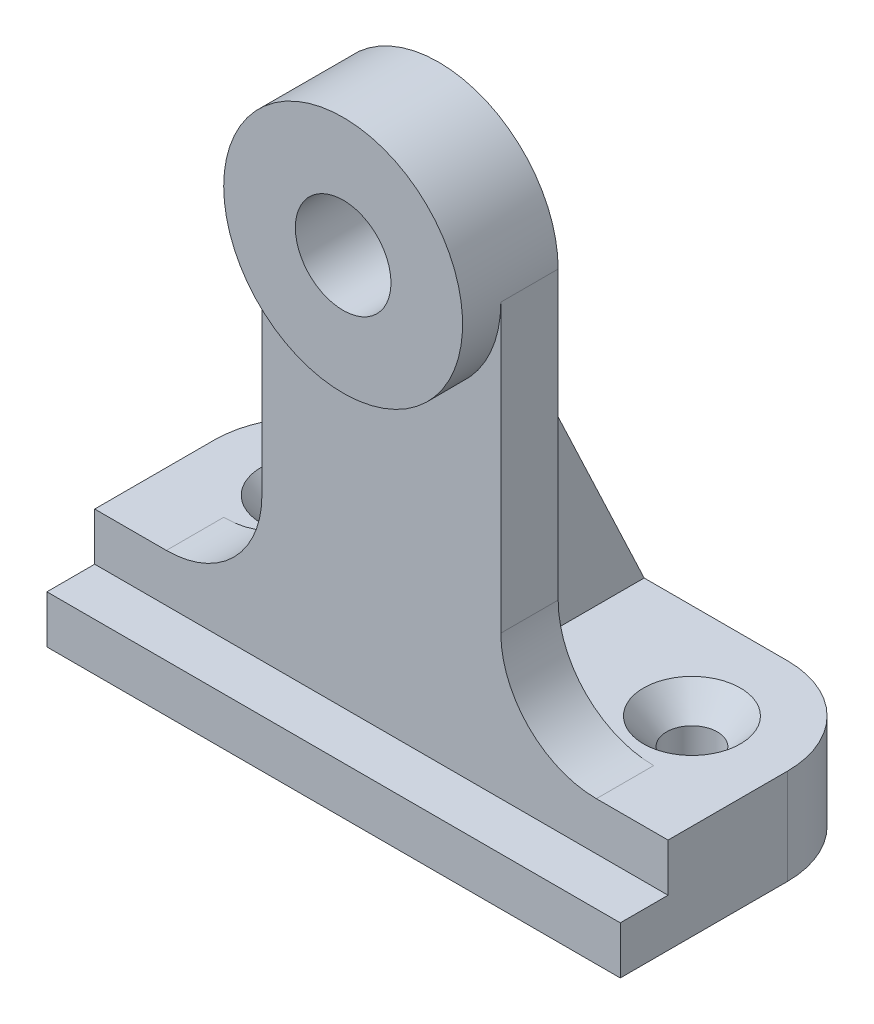
ISO-10303-21;
HEADER;
FILE_DESCRIPTION(('STEP AP214'),'2;1');
FILE_NAME('part.step','',(''),(''),'','','');
FILE_SCHEMA(('AUTOMOTIVE_DESIGN { 1 0 10303 214 1 1 1 1 }'));
ENDSEC;
DATA;
#1=APPLICATION_CONTEXT('core data for automotive mechanical design processes');
#2=APPLICATION_PROTOCOL_DEFINITION('international standard','automotive_design',2000,#1);
#3=PRODUCT_CONTEXT('',#1,'mechanical');
#4=PRODUCT('Part','Part','',(#3));
#5=PRODUCT_RELATED_PRODUCT_CATEGORY('part','',(#4));
#6=PRODUCT_DEFINITION_FORMATION('','',#4);
#7=PRODUCT_DEFINITION_CONTEXT('part definition',#1,'design');
#8=PRODUCT_DEFINITION('design','',#6,#7);
#9=PRODUCT_DEFINITION_SHAPE('','',#8);
#10=(LENGTH_UNIT() NAMED_UNIT(*) SI_UNIT(.MILLI.,.METRE.));
#11=(NAMED_UNIT(*) PLANE_ANGLE_UNIT() SI_UNIT($,.RADIAN.));
#12=(NAMED_UNIT(*) SI_UNIT($,.STERADIAN.) SOLID_ANGLE_UNIT());
#13=UNCERTAINTY_MEASURE_WITH_UNIT(LENGTH_MEASURE(1.E-05),#10,'distance_accuracy_value','');
#14=(GEOMETRIC_REPRESENTATION_CONTEXT(3) GLOBAL_UNCERTAINTY_ASSIGNED_CONTEXT((#13)) GLOBAL_UNIT_ASSIGNED_CONTEXT((#10,
#11,#12)) REPRESENTATION_CONTEXT('',''));
#15=CARTESIAN_POINT('',(0.,0.,0.));
#16=DIRECTION('',(0.,0.,1.));
#17=DIRECTION('',(1.,0.,0.));
#18=AXIS2_PLACEMENT_3D('',#15,#16,#17);
#19=CARTESIAN_POINT('',(25.4,12.7,-4.7625));
#20=DIRECTION('',(0.,-1.,0.));
#21=DIRECTION('',(0.,0.,-1.));
#22=AXIS2_PLACEMENT_3D('',#19,#20,#21);
#23=PLANE('',#22);
#24=CARTESIAN_POINT('',(-25.4,12.7,-4.7625));
#25=DIRECTION('',(0.,1.,0.));
#26=DIRECTION('',(0.,0.,1.));
#27=AXIS2_PLACEMENT_3D('',#24,#25,#26);
#28=CIRCLE('',#27,6.4389);
#29=CARTESIAN_POINT('',(-25.4,12.7,1.6764));
#30=VERTEX_POINT('',#29);
#31=EDGE_CURVE('E236',#30,#30,#28,.T.);
#32=ORIENTED_EDGE('',*,*,#31,.F.);
#33=EDGE_LOOP('',(#32));
#34=FACE_BOUND('',#33,.T.);
#35=DIRECTION('',(0.,0.,-1.));
#36=VECTOR('',#35,1.);
#37=CARTESIAN_POINT('',(-6.35,12.7,3.4925));
#38=LINE('',#37,#36);
#39=CARTESIAN_POINT('',(-6.35,12.7,3.4925));
#40=VERTEX_POINT('',#39);
#41=CARTESIAN_POINT('',(-6.35,12.7,-17.4625));
#42=VERTEX_POINT('',#41);
#43=EDGE_CURVE('E55',#40,#42,#38,.T.);
#44=ORIENTED_EDGE('',*,*,#43,.T.);
#45=DIRECTION('',(-1.,0.,0.));
#46=VECTOR('',#45,1.);
#47=CARTESIAN_POINT('',(-25.4,12.7,-17.4625));
#48=LINE('',#47,#46);
#49=CARTESIAN_POINT('',(-25.4,12.7,-17.4625));
#50=VERTEX_POINT('',#49);
#51=EDGE_CURVE('E295',#42,#50,#48,.T.);
#52=ORIENTED_EDGE('',*,*,#51,.T.);
#53=CARTESIAN_POINT('',(-25.4,12.7,-4.7625));
#54=DIRECTION('',(0.,1.,0.));
#55=DIRECTION('',(0.,0.,1.));
#56=AXIS2_PLACEMENT_3D('',#53,#54,#55);
#57=CIRCLE('',#56,12.7);
#58=CARTESIAN_POINT('',(-38.1,12.7,-4.7625));
#59=VERTEX_POINT('',#58);
#60=EDGE_CURVE('E300',#50,#59,#57,.T.);
#61=ORIENTED_EDGE('',*,*,#60,.T.);
#62=DIRECTION('',(0.,0.,1.));
#63=VECTOR('',#62,1.);
#64=CARTESIAN_POINT('',(-38.1,12.7,-4.76249999999999));
#65=LINE('',#64,#63);
#66=CARTESIAN_POINT('',(-38.1,12.7,11.1125));
#67=VERTEX_POINT('',#66);
#68=EDGE_CURVE('E303',#59,#67,#65,.T.);
#69=ORIENTED_EDGE('',*,*,#68,.T.);
#70=DIRECTION('',(1.,0.,0.));
#71=VECTOR('',#70,1.);
#72=CARTESIAN_POINT('',(-38.1,12.7,11.1125));
#73=LINE('',#72,#71);
#74=CARTESIAN_POINT('',(-28.575,12.7,11.1125));
#75=VERTEX_POINT('',#74);
#76=EDGE_CURVE('E307',#67,#75,#73,.T.);
#77=ORIENTED_EDGE('',*,*,#76,.T.);
#78=DIRECTION('',(0.,0.,1.));
#79=VECTOR('',#78,1.);
#80=CARTESIAN_POINT('',(-28.575,12.7,-4.7625));
#81=LINE('',#80,#79);
#82=CARTESIAN_POINT('',(-28.575,12.7,3.4925));
#83=VERTEX_POINT('',#82);
#84=EDGE_CURVE('E351',#75,#83,#81,.F.);
#85=ORIENTED_EDGE('',*,*,#84,.T.);
#86=DIRECTION('',(1.,0.,0.));
#87=VECTOR('',#86,1.);
#88=CARTESIAN_POINT('',(-15.875,12.7,3.4925));
#89=LINE('',#88,#87);
#90=EDGE_CURVE('E216',#83,#40,#89,.T.);
#91=ORIENTED_EDGE('',*,*,#90,.T.);
#92=EDGE_LOOP('',(#44,#52,#61,#69,#77,#85,#91));
#93=FACE_BOUND('',#92,.T.);
#94=ADVANCED_FACE('F39',(#34,#93),#23,.F.);
#95=CARTESIAN_POINT('',(25.4,12.7,-4.7625));
#96=DIRECTION('',(0.,1.,0.));
#97=DIRECTION('',(0.,0.,1.));
#98=AXIS2_PLACEMENT_3D('',#95,#96,#97);
#99=CIRCLE('',#98,6.4389);
#100=CARTESIAN_POINT('',(25.4,12.7,1.6764));
#101=VERTEX_POINT('',#100);
#102=EDGE_CURVE('E251',#101,#101,#99,.T.);
#103=ORIENTED_EDGE('',*,*,#102,.F.);
#104=EDGE_LOOP('',(#103));
#105=FACE_BOUND('',#104,.T.);
#106=CARTESIAN_POINT('',(25.4,12.7,-17.4625));
#107=VERTEX_POINT('',#106);
#108=CARTESIAN_POINT('',(6.35,12.7,-17.4625));
#109=VERTEX_POINT('',#108);
#110=EDGE_CURVE('E297',#107,#109,#48,.T.);
#111=ORIENTED_EDGE('',*,*,#110,.T.);
#112=DIRECTION('',(0.,0.,-1.));
#113=VECTOR('',#112,1.);
#114=CARTESIAN_POINT('',(6.35,12.7,3.4925));
#115=LINE('',#114,#113);
#116=CARTESIAN_POINT('',(6.35,12.7,3.4925));
#117=VERTEX_POINT('',#116);
#118=EDGE_CURVE('E409',#117,#109,#115,.T.);
#119=ORIENTED_EDGE('',*,*,#118,.F.);
#120=CARTESIAN_POINT('',(28.575,12.7,3.4925));
#121=VERTEX_POINT('',#120);
#122=EDGE_CURVE('E214',#117,#121,#89,.T.);
#123=ORIENTED_EDGE('',*,*,#122,.T.);
#124=DIRECTION('',(0.,0.,1.));
#125=VECTOR('',#124,1.);
#126=CARTESIAN_POINT('',(28.575,12.7,-4.7625));
#127=LINE('',#126,#125);
#128=CARTESIAN_POINT('',(28.575,12.7,11.1125));
#129=VERTEX_POINT('',#128);
#130=EDGE_CURVE('E355',#121,#129,#127,.T.);
#131=ORIENTED_EDGE('',*,*,#130,.T.);
#132=CARTESIAN_POINT('',(38.1,12.7,11.1125));
#133=VERTEX_POINT('',#132);
#134=EDGE_CURVE('E306',#129,#133,#73,.T.);
#135=ORIENTED_EDGE('',*,*,#134,.T.);
#136=DIRECTION('',(0.,0.,-1.));
#137=VECTOR('',#136,1.);
#138=CARTESIAN_POINT('',(38.1,12.7,-4.7625));
#139=LINE('',#138,#137);
#140=CARTESIAN_POINT('',(38.1,12.7,-4.7625));
#141=VERTEX_POINT('',#140);
#142=EDGE_CURVE('E311',#133,#141,#139,.T.);
#143=ORIENTED_EDGE('',*,*,#142,.T.);
#144=CARTESIAN_POINT('',(25.4,12.7,-4.7625));
#145=DIRECTION('',(0.,1.,0.));
#146=DIRECTION('',(0.,0.,-1.));
#147=AXIS2_PLACEMENT_3D('',#144,#145,#146);
#148=CIRCLE('',#147,12.7);
#149=EDGE_CURVE('E291',#141,#107,#148,.T.);
#150=ORIENTED_EDGE('',*,*,#149,.T.);
#151=EDGE_LOOP('',(#111,#119,#123,#131,#135,#143,#150));
#152=FACE_BOUND('',#151,.T.);
#153=ADVANCED_FACE('F399',(#105,#152),#23,.F.);
#154=CARTESIAN_POINT('',(-38.1,12.7,11.1125));
#155=DIRECTION('',(0.,0.,-1.));
#156=DIRECTION('',(-1.,0.,0.));
#157=AXIS2_PLACEMENT_3D('',#154,#155,#156);
#158=PLANE('',#157);
#159=DIRECTION('',(-1.,0.,0.));
#160=VECTOR('',#159,1.);
#161=CARTESIAN_POINT('',(-38.1,6.35,11.1125));
#162=LINE('',#161,#160);
#163=CARTESIAN_POINT('',(38.1,6.35,11.1125));
#164=VERTEX_POINT('',#163);
#165=CARTESIAN_POINT('',(-38.1,6.35,11.1125));
#166=VERTEX_POINT('',#165);
#167=EDGE_CURVE('E275',#164,#166,#162,.T.);
#168=ORIENTED_EDGE('',*,*,#167,.F.);
#169=DIRECTION('',(0.,-1.,0.));
#170=VECTOR('',#169,1.);
#171=CARTESIAN_POINT('',(38.1,12.7,11.1125));
#172=LINE('',#171,#170);
#173=EDGE_CURVE('E332',#133,#164,#172,.T.);
#174=ORIENTED_EDGE('',*,*,#173,.F.);
#175=ORIENTED_EDGE('',*,*,#134,.F.);
#176=CARTESIAN_POINT('',(28.575,25.4,11.1125));
#177=DIRECTION('',(0.,0.,-1.));
#178=DIRECTION('',(-1.,0.,0.));
#179=AXIS2_PLACEMENT_3D('',#176,#177,#178);
#180=CIRCLE('',#179,12.7);
#181=CARTESIAN_POINT('',(15.875,25.4,11.1125));
#182=VERTEX_POINT('',#181);
#183=EDGE_CURVE('E366',#129,#182,#180,.T.);
#184=ORIENTED_EDGE('',*,*,#183,.T.);
#185=DIRECTION('',(0.,1.,0.));
#186=VECTOR('',#185,1.);
#187=CARTESIAN_POINT('',(15.875,12.7,11.1125));
#188=LINE('',#187,#186);
#189=CARTESIAN_POINT('',(15.875,63.5,11.1125));
#190=VERTEX_POINT('',#189);
#191=EDGE_CURVE('E226',#182,#190,#188,.T.);
#192=ORIENTED_EDGE('',*,*,#191,.T.);
#193=CARTESIAN_POINT('',(0.,63.5,11.1125));
#194=DIRECTION('',(0.,0.,-1.));
#195=DIRECTION('',(1.,0.,0.));
#196=AXIS2_PLACEMENT_3D('',#193,#194,#195);
#197=CIRCLE('',#196,15.875);
#198=CARTESIAN_POINT('',(-15.875,63.5,11.1125));
#199=VERTEX_POINT('',#198);
#200=EDGE_CURVE('E215',#190,#199,#197,.T.);
#201=ORIENTED_EDGE('',*,*,#200,.T.);
#202=DIRECTION('',(0.,-1.,0.));
#203=VECTOR('',#202,1.);
#204=CARTESIAN_POINT('',(-15.875,12.7,11.1125));
#205=LINE('',#204,#203);
#206=CARTESIAN_POINT('',(-15.875,25.4,11.1125));
#207=VERTEX_POINT('',#206);
#208=EDGE_CURVE('E206',#199,#207,#205,.T.);
#209=ORIENTED_EDGE('',*,*,#208,.T.);
#210=CARTESIAN_POINT('',(-28.575,25.4,11.1125));
#211=DIRECTION('',(0.,0.,-1.));
#212=DIRECTION('',(-1.,0.,0.));
#213=AXIS2_PLACEMENT_3D('',#210,#211,#212);
#214=CIRCLE('',#213,12.7);
#215=EDGE_CURVE('E48',#207,#75,#214,.T.);
#216=ORIENTED_EDGE('',*,*,#215,.T.);
#217=ORIENTED_EDGE('',*,*,#76,.F.);
#218=DIRECTION('',(0.,-1.,0.));
#219=VECTOR('',#218,1.);
#220=CARTESIAN_POINT('',(-38.1,12.7,11.1125));
#221=LINE('',#220,#219);
#222=EDGE_CURVE('E336',#67,#166,#221,.T.);
#223=ORIENTED_EDGE('',*,*,#222,.T.);
#224=EDGE_LOOP('',(#168,#174,#175,#184,#192,#201,#209,#216,#217,#223));
#225=FACE_BOUND('',#224,.T.);
#226=ADVANCED_FACE('F375',(#225),#158,.F.);
#227=CARTESIAN_POINT('',(25.4,12.7,-4.7625));
#228=DIRECTION('',(0.,-1.,0.));
#229=DIRECTION('',(0.,0.,-1.));
#230=AXIS2_PLACEMENT_3D('',#227,#228,#229);
#231=CYLINDRICAL_SURFACE('',#230,12.7);
#232=CARTESIAN_POINT('',(25.4,0.,-4.7625));
#233=DIRECTION('',(0.,1.,0.));
#234=DIRECTION('',(0.,0.,-1.));
#235=AXIS2_PLACEMENT_3D('',#232,#233,#234);
#236=CIRCLE('',#235,12.7);
#237=CARTESIAN_POINT('',(38.1,0.,-4.7625));
#238=VERTEX_POINT('',#237);
#239=CARTESIAN_POINT('',(25.4,0.,-17.4625));
#240=VERTEX_POINT('',#239);
#241=EDGE_CURVE('E290',#238,#240,#236,.T.);
#242=ORIENTED_EDGE('',*,*,#241,.T.);
#243=DIRECTION('',(0.,-1.,0.));
#244=VECTOR('',#243,1.);
#245=CARTESIAN_POINT('',(25.4,12.7,-17.4625));
#246=LINE('',#245,#244);
#247=EDGE_CURVE('E347',#107,#240,#246,.T.);
#248=ORIENTED_EDGE('',*,*,#247,.F.);
#249=ORIENTED_EDGE('',*,*,#149,.F.);
#250=DIRECTION('',(0.,-1.,0.));
#251=VECTOR('',#250,1.);
#252=CARTESIAN_POINT('',(38.1,12.7,-4.7625));
#253=LINE('',#252,#251);
#254=EDGE_CURVE('E314',#141,#238,#253,.T.);
#255=ORIENTED_EDGE('',*,*,#254,.T.);
#256=EDGE_LOOP('',(#242,#248,#249,#255));
#257=FACE_BOUND('',#256,.T.);
#258=ADVANCED_FACE('F453',(#257),#231,.T.);
#259=CARTESIAN_POINT('',(-25.4,12.7,-17.4625));
#260=DIRECTION('',(0.,0.,1.));
#261=DIRECTION('',(1.,0.,0.));
#262=AXIS2_PLACEMENT_3D('',#259,#260,#261);
#263=PLANE('',#262);
#264=DIRECTION('',(-1.,0.,0.));
#265=VECTOR('',#264,1.);
#266=CARTESIAN_POINT('',(-25.4,0.,-17.4625));
#267=LINE('',#266,#265);
#268=CARTESIAN_POINT('',(-25.4,0.,-17.4625));
#269=VERTEX_POINT('',#268);
#270=EDGE_CURVE('E318',#240,#269,#267,.T.);
#271=ORIENTED_EDGE('',*,*,#270,.T.);
#272=DIRECTION('',(0.,-1.,0.));
#273=VECTOR('',#272,1.);
#274=CARTESIAN_POINT('',(-25.4,12.7,-17.4625));
#275=LINE('',#274,#273);
#276=EDGE_CURVE('E343',#50,#269,#275,.T.);
#277=ORIENTED_EDGE('',*,*,#276,.F.);
#278=ORIENTED_EDGE('',*,*,#51,.F.);
#279=DIRECTION('',(-1.,0.,0.));
#280=VECTOR('',#279,1.);
#281=CARTESIAN_POINT('',(6.35,12.7,-17.4625));
#282=LINE('',#281,#280);
#283=EDGE_CURVE('E62',#109,#42,#282,.T.);
#284=ORIENTED_EDGE('',*,*,#283,.F.);
#285=ORIENTED_EDGE('',*,*,#110,.F.);
#286=ORIENTED_EDGE('',*,*,#247,.T.);
#287=EDGE_LOOP('',(#271,#277,#278,#284,#285,#286));
#288=FACE_BOUND('',#287,.T.);
#289=ADVANCED_FACE('F460',(#288),#263,.F.);
#290=CARTESIAN_POINT('',(-25.4,12.7,-4.7625));
#291=DIRECTION('',(0.,-1.,0.));
#292=DIRECTION('',(0.,0.,-1.));
#293=AXIS2_PLACEMENT_3D('',#290,#291,#292);
#294=CYLINDRICAL_SURFACE('',#293,12.7);
#295=CARTESIAN_POINT('',(-25.4,0.,-4.7625));
#296=DIRECTION('',(0.,1.,0.));
#297=DIRECTION('',(0.,0.,1.));
#298=AXIS2_PLACEMENT_3D('',#295,#296,#297);
#299=CIRCLE('',#298,12.7);
#300=CARTESIAN_POINT('',(-38.1,0.,-4.7625));
#301=VERTEX_POINT('',#300);
#302=EDGE_CURVE('E321',#269,#301,#299,.T.);
#303=ORIENTED_EDGE('',*,*,#302,.T.);
#304=DIRECTION('',(0.,-1.,0.));
#305=VECTOR('',#304,1.);
#306=CARTESIAN_POINT('',(-38.1,12.7,-4.7625));
#307=LINE('',#306,#305);
#308=EDGE_CURVE('E339',#59,#301,#307,.T.);
#309=ORIENTED_EDGE('',*,*,#308,.F.);
#310=ORIENTED_EDGE('',*,*,#60,.F.);
#311=ORIENTED_EDGE('',*,*,#276,.T.);
#312=EDGE_LOOP('',(#303,#309,#310,#311));
#313=FACE_BOUND('',#312,.T.);
#314=ADVANCED_FACE('F456',(#313),#294,.T.);
#315=CARTESIAN_POINT('',(-38.1,12.7,-4.76249999999999));
#316=DIRECTION('',(1.,0.,0.));
#317=DIRECTION('',(0.,0.,-1.));
#318=AXIS2_PLACEMENT_3D('',#315,#316,#317);
#319=PLANE('',#318);
#320=DIRECTION('',(0.,0.,1.));
#321=VECTOR('',#320,1.);
#322=CARTESIAN_POINT('',(-38.1,0.,-4.76249999999999));
#323=LINE('',#322,#321);
#324=CARTESIAN_POINT('',(-38.1,0.,17.4625));
#325=VERTEX_POINT('',#324);
#326=EDGE_CURVE('E324',#301,#325,#323,.T.);
#327=ORIENTED_EDGE('',*,*,#326,.T.);
#328=DIRECTION('',(0.,-1.,0.));
#329=VECTOR('',#328,1.);
#330=CARTESIAN_POINT('',(-38.1,6.35,17.4625));
#331=LINE('',#330,#329);
#332=CARTESIAN_POINT('',(-38.1,6.35,17.4625));
#333=VERTEX_POINT('',#332);
#334=EDGE_CURVE('E286',#333,#325,#331,.T.);
#335=ORIENTED_EDGE('',*,*,#334,.F.);
#336=DIRECTION('',(0.,0.,1.));
#337=VECTOR('',#336,1.);
#338=CARTESIAN_POINT('',(-38.1,6.35,11.1125));
#339=LINE('',#338,#337);
#340=EDGE_CURVE('E264',#166,#333,#339,.T.);
#341=ORIENTED_EDGE('',*,*,#340,.F.);
#342=ORIENTED_EDGE('',*,*,#222,.F.);
#343=ORIENTED_EDGE('',*,*,#68,.F.);
#344=ORIENTED_EDGE('',*,*,#308,.T.);
#345=EDGE_LOOP('',(#327,#335,#341,#342,#343,#344));
#346=FACE_BOUND('',#345,.T.);
#347=ADVANCED_FACE('F449',(#346),#319,.F.);
#348=CARTESIAN_POINT('',(38.1,12.7,-4.7625));
#349=DIRECTION('',(-1.,0.,0.));
#350=DIRECTION('',(0.,0.,1.));
#351=AXIS2_PLACEMENT_3D('',#348,#349,#350);
#352=PLANE('',#351);
#353=DIRECTION('',(0.,0.,-1.));
#354=VECTOR('',#353,1.);
#355=CARTESIAN_POINT('',(38.1,0.,-4.7625));
#356=LINE('',#355,#354);
#357=CARTESIAN_POINT('',(38.1,0.,17.4625));
#358=VERTEX_POINT('',#357);
#359=EDGE_CURVE('E296',#358,#238,#356,.T.);
#360=ORIENTED_EDGE('',*,*,#359,.T.);
#361=ORIENTED_EDGE('',*,*,#254,.F.);
#362=ORIENTED_EDGE('',*,*,#142,.F.);
#363=ORIENTED_EDGE('',*,*,#173,.T.);
#364=DIRECTION('',(0.,0.,-1.));
#365=VECTOR('',#364,1.);
#366=CARTESIAN_POINT('',(38.1,6.35,11.1125));
#367=LINE('',#366,#365);
#368=CARTESIAN_POINT('',(38.1,6.35,17.4625));
#369=VERTEX_POINT('',#368);
#370=EDGE_CURVE('E271',#369,#164,#367,.T.);
#371=ORIENTED_EDGE('',*,*,#370,.F.);
#372=DIRECTION('',(0.,-1.,0.));
#373=VECTOR('',#372,1.);
#374=CARTESIAN_POINT('',(38.1,6.35,17.4625));
#375=LINE('',#374,#373);
#376=EDGE_CURVE('E279',#369,#358,#375,.T.);
#377=ORIENTED_EDGE('',*,*,#376,.T.);
#378=EDGE_LOOP('',(#360,#361,#362,#363,#371,#377));
#379=FACE_BOUND('',#378,.T.);
#380=ADVANCED_FACE('F445',(#379),#352,.F.);
#381=CARTESIAN_POINT('',(25.4,0.,-4.7625));
#382=DIRECTION('',(0.,-1.,0.));
#383=DIRECTION('',(0.,0.,-1.));
#384=AXIS2_PLACEMENT_3D('',#381,#382,#383);
#385=PLANE('',#384);
#386=CARTESIAN_POINT('',(-25.4,0.,-4.7625));
#387=DIRECTION('',(0.,1.,0.));
#388=DIRECTION('',(0.,0.,1.));
#389=AXIS2_PLACEMENT_3D('',#386,#387,#388);
#390=CIRCLE('',#389,3.3782);
#391=CARTESIAN_POINT('',(-25.4,0.,-1.3843));
#392=VERTEX_POINT('',#391);
#393=EDGE_CURVE('E247',#392,#392,#390,.T.);
#394=ORIENTED_EDGE('',*,*,#393,.T.);
#395=EDGE_LOOP('',(#394));
#396=FACE_BOUND('',#395,.T.);
#397=CARTESIAN_POINT('',(25.4,0.,-4.7625));
#398=DIRECTION('',(0.,1.,0.));
#399=DIRECTION('',(0.,0.,1.));
#400=AXIS2_PLACEMENT_3D('',#397,#398,#399);
#401=CIRCLE('',#400,3.3782);
#402=CARTESIAN_POINT('',(25.4,0.,-1.3843));
#403=VERTEX_POINT('',#402);
#404=EDGE_CURVE('E259',#403,#403,#401,.T.);
#405=ORIENTED_EDGE('',*,*,#404,.T.);
#406=EDGE_LOOP('',(#405));
#407=FACE_BOUND('',#406,.T.);
#408=ORIENTED_EDGE('',*,*,#241,.F.);
#409=ORIENTED_EDGE('',*,*,#359,.F.);
#410=DIRECTION('',(1.,0.,0.));
#411=VECTOR('',#410,1.);
#412=CARTESIAN_POINT('',(-38.1,0.,17.4625));
#413=LINE('',#412,#411);
#414=EDGE_CURVE('E263',#325,#358,#413,.T.);
#415=ORIENTED_EDGE('',*,*,#414,.F.);
#416=ORIENTED_EDGE('',*,*,#326,.F.);
#417=ORIENTED_EDGE('',*,*,#302,.F.);
#418=ORIENTED_EDGE('',*,*,#270,.F.);
#419=EDGE_LOOP('',(#408,#409,#415,#416,#417,#418));
#420=FACE_BOUND('',#419,.T.);
#421=ADVANCED_FACE('F442',(#396,#407,#420),#385,.T.);
#422=CARTESIAN_POINT('',(-38.1,6.35,17.4625));
#423=DIRECTION('',(0.,0.,-1.));
#424=DIRECTION('',(-1.,0.,0.));
#425=AXIS2_PLACEMENT_3D('',#422,#423,#424);
#426=PLANE('',#425);
#427=ORIENTED_EDGE('',*,*,#414,.T.);
#428=ORIENTED_EDGE('',*,*,#376,.F.);
#429=DIRECTION('',(1.,0.,0.));
#430=VECTOR('',#429,1.);
#431=CARTESIAN_POINT('',(-38.1,6.35,17.4625));
#432=LINE('',#431,#430);
#433=EDGE_CURVE('E268',#333,#369,#432,.T.);
#434=ORIENTED_EDGE('',*,*,#433,.F.);
#435=ORIENTED_EDGE('',*,*,#334,.T.);
#436=EDGE_LOOP('',(#427,#428,#434,#435));
#437=FACE_BOUND('',#436,.T.);
#438=ADVANCED_FACE('F440',(#437),#426,.F.);
#439=CARTESIAN_POINT('',(0.,6.35,0.));
#440=DIRECTION('',(0.,1.,0.));
#441=DIRECTION('',(0.,0.,1.));
#442=AXIS2_PLACEMENT_3D('',#439,#440,#441);
#443=PLANE('',#442);
#444=ORIENTED_EDGE('',*,*,#340,.T.);
#445=ORIENTED_EDGE('',*,*,#433,.T.);
#446=ORIENTED_EDGE('',*,*,#370,.T.);
#447=ORIENTED_EDGE('',*,*,#167,.T.);
#448=EDGE_LOOP('',(#444,#445,#446,#447));
#449=FACE_BOUND('',#448,.T.);
#450=ADVANCED_FACE('F495',(#449),#443,.T.);
#451=CARTESIAN_POINT('',(25.4,12.7,-4.7625));
#452=DIRECTION('',(0.,1.,0.));
#453=DIRECTION('',(0.,0.,1.));
#454=AXIS2_PLACEMENT_3D('',#451,#452,#453);
#455=CYLINDRICAL_SURFACE('',#454,3.3782);
#456=ORIENTED_EDGE('',*,*,#404,.F.);
#457=EDGE_LOOP('',(#456));
#458=FACE_BOUND('',#457,.T.);
#459=CARTESIAN_POINT('',(25.4,9.17906741601865,-4.7625));
#460=DIRECTION('',(0.,1.,0.));
#461=DIRECTION('',(0.,0.,1.));
#462=AXIS2_PLACEMENT_3D('',#459,#460,#461);
#463=CIRCLE('',#462,3.3782);
#464=CARTESIAN_POINT('',(25.4,9.17906741601865,-1.3843));
#465=VERTEX_POINT('',#464);
#466=EDGE_CURVE('E255',#465,#465,#463,.T.);
#467=ORIENTED_EDGE('',*,*,#466,.T.);
#468=EDGE_LOOP('',(#467));
#469=FACE_BOUND('',#468,.T.);
#470=ADVANCED_FACE('F492',(#458,#469),#455,.F.);
#471=CARTESIAN_POINT('',(25.4,12.7,-4.7625));
#472=DIRECTION('',(0.,1.,0.));
#473=DIRECTION('',(0.,0.,1.));
#474=AXIS2_PLACEMENT_3D('',#471,#472,#473);
#475=CONICAL_SURFACE('',#474,6.4389,0.715584993317675);
#476=ORIENTED_EDGE('',*,*,#466,.F.);
#477=EDGE_LOOP('',(#476));
#478=FACE_BOUND('',#477,.T.);
#479=ORIENTED_EDGE('',*,*,#102,.T.);
#480=EDGE_LOOP('',(#479));
#481=FACE_BOUND('',#480,.T.);
#482=ADVANCED_FACE('F488',(#478,#481),#475,.F.);
#483=CARTESIAN_POINT('',(-25.4,12.7,-4.7625));
#484=DIRECTION('',(0.,1.,0.));
#485=DIRECTION('',(0.,0.,1.));
#486=AXIS2_PLACEMENT_3D('',#483,#484,#485);
#487=CYLINDRICAL_SURFACE('',#486,3.3782);
#488=ORIENTED_EDGE('',*,*,#393,.F.);
#489=EDGE_LOOP('',(#488));
#490=FACE_BOUND('',#489,.T.);
#491=CARTESIAN_POINT('',(-25.4,9.17906741601865,-4.7625));
#492=DIRECTION('',(0.,1.,0.));
#493=DIRECTION('',(0.,0.,1.));
#494=AXIS2_PLACEMENT_3D('',#491,#492,#493);
#495=CIRCLE('',#494,3.3782);
#496=CARTESIAN_POINT('',(-25.4,9.17906741601865,-1.3843));
#497=VERTEX_POINT('',#496);
#498=EDGE_CURVE('E243',#497,#497,#495,.T.);
#499=ORIENTED_EDGE('',*,*,#498,.T.);
#500=EDGE_LOOP('',(#499));
#501=FACE_BOUND('',#500,.T.);
#502=ADVANCED_FACE('F484',(#490,#501),#487,.F.);
#503=CARTESIAN_POINT('',(-25.4,12.7,-4.7625));
#504=DIRECTION('',(0.,1.,0.));
#505=DIRECTION('',(0.,0.,1.));
#506=AXIS2_PLACEMENT_3D('',#503,#504,#505);
#507=CONICAL_SURFACE('',#506,6.4389,0.715584993317675);
#508=ORIENTED_EDGE('',*,*,#498,.F.);
#509=EDGE_LOOP('',(#508));
#510=FACE_BOUND('',#509,.T.);
#511=ORIENTED_EDGE('',*,*,#31,.T.);
#512=EDGE_LOOP('',(#511));
#513=FACE_BOUND('',#512,.T.);
#514=ADVANCED_FACE('F481',(#510,#513),#507,.F.);
#515=CARTESIAN_POINT('',(-15.875,12.7,3.4925));
#516=DIRECTION('',(-1.,0.,0.));
#517=DIRECTION('',(0.,0.,1.));
#518=AXIS2_PLACEMENT_3D('',#515,#516,#517);
#519=PLANE('',#518);
#520=DIRECTION('',(0.,-1.,0.));
#521=VECTOR('',#520,1.);
#522=CARTESIAN_POINT('',(-15.875,12.7,3.4925));
#523=LINE('',#522,#521);
#524=CARTESIAN_POINT('',(-15.875,63.5,3.4925));
#525=VERTEX_POINT('',#524);
#526=CARTESIAN_POINT('',(-15.875,25.4,3.4925));
#527=VERTEX_POINT('',#526);
#528=EDGE_CURVE('E210',#525,#527,#523,.T.);
#529=ORIENTED_EDGE('',*,*,#528,.T.);
#530=DIRECTION('',(0.,0.,1.));
#531=VECTOR('',#530,1.);
#532=CARTESIAN_POINT('',(-15.875,25.4,3.4925));
#533=LINE('',#532,#531);
#534=EDGE_CURVE('E362',#527,#207,#533,.T.);
#535=ORIENTED_EDGE('',*,*,#534,.T.);
#536=ORIENTED_EDGE('',*,*,#208,.F.);
#537=DIRECTION('',(0.,0.,1.));
#538=VECTOR('',#537,1.);
#539=CARTESIAN_POINT('',(-15.875,63.5,3.4925));
#540=LINE('',#539,#538);
#541=EDGE_CURVE('E232',#525,#199,#540,.T.);
#542=ORIENTED_EDGE('',*,*,#541,.F.);
#543=EDGE_LOOP('',(#529,#535,#536,#542));
#544=FACE_BOUND('',#543,.T.);
#545=ADVANCED_FACE('F384',(#544),#519,.T.);
#546=CARTESIAN_POINT('',(15.875,12.7,3.4925));
#547=DIRECTION('',(1.,0.,0.));
#548=DIRECTION('',(0.,0.,-1.));
#549=AXIS2_PLACEMENT_3D('',#546,#547,#548);
#550=PLANE('',#549);
#551=ORIENTED_EDGE('',*,*,#191,.F.);
#552=DIRECTION('',(0.,0.,1.));
#553=VECTOR('',#552,1.);
#554=CARTESIAN_POINT('',(15.875,25.4,3.4925));
#555=LINE('',#554,#553);
#556=CARTESIAN_POINT('',(15.875,25.4,3.4925));
#557=VERTEX_POINT('',#556);
#558=EDGE_CURVE('E359',#182,#557,#555,.F.);
#559=ORIENTED_EDGE('',*,*,#558,.T.);
#560=DIRECTION('',(0.,1.,0.));
#561=VECTOR('',#560,1.);
#562=CARTESIAN_POINT('',(15.875,12.7,3.4925));
#563=LINE('',#562,#561);
#564=CARTESIAN_POINT('',(15.875,63.5,3.4925));
#565=VERTEX_POINT('',#564);
#566=EDGE_CURVE('E219',#557,#565,#563,.T.);
#567=ORIENTED_EDGE('',*,*,#566,.T.);
#568=DIRECTION('',(0.,0.,1.));
#569=VECTOR('',#568,1.);
#570=CARTESIAN_POINT('',(15.875,63.5,3.4925));
#571=LINE('',#570,#569);
#572=EDGE_CURVE('E222',#565,#190,#571,.T.);
#573=ORIENTED_EDGE('',*,*,#572,.T.);
#574=EDGE_LOOP('',(#551,#559,#567,#573));
#575=FACE_BOUND('',#574,.T.);
#576=ADVANCED_FACE('F471',(#575),#550,.T.);
#577=CARTESIAN_POINT('',(0.,63.5,3.4925));
#578=DIRECTION('',(0.,0.,1.));
#579=DIRECTION('',(1.,0.,0.));
#580=AXIS2_PLACEMENT_3D('',#577,#578,#579);
#581=PLANE('',#580);
#582=ORIENTED_EDGE('',*,*,#122,.F.);
#583=DIRECTION('',(0.,-1.,0.));
#584=VECTOR('',#583,1.);
#585=CARTESIAN_POINT('',(6.35,57.15,3.4925));
#586=LINE('',#585,#584);
#587=CARTESIAN_POINT('',(6.35,57.15,3.4925));
#588=VERTEX_POINT('',#587);
#589=EDGE_CURVE('E182',#588,#117,#586,.T.);
#590=ORIENTED_EDGE('',*,*,#589,.F.);
#591=DIRECTION('',(-1.,0.,0.));
#592=VECTOR('',#591,1.);
#593=CARTESIAN_POINT('',(6.35,57.15,3.4925));
#594=LINE('',#593,#592);
#595=CARTESIAN_POINT('',(0.,57.15,3.4925));
#596=VERTEX_POINT('',#595);
#597=EDGE_CURVE('E173',#588,#596,#594,.T.);
#598=ORIENTED_EDGE('',*,*,#597,.T.);
#599=CARTESIAN_POINT('',(0.,63.5,3.4925));
#600=DIRECTION('',(0.,0.,-1.));
#601=DIRECTION('',(-1.,0.,0.));
#602=AXIS2_PLACEMENT_3D('',#599,#600,#601);
#603=CIRCLE('',#602,6.35);
#604=EDGE_CURVE('E169',#596,#596,#603,.T.);
#605=ORIENTED_EDGE('',*,*,#604,.F.);
#606=CARTESIAN_POINT('',(-6.35,57.15,3.4925));
#607=VERTEX_POINT('',#606);
#608=EDGE_CURVE('E162',#596,#607,#594,.T.);
#609=ORIENTED_EDGE('',*,*,#608,.T.);
#610=DIRECTION('',(0.,-1.,0.));
#611=VECTOR('',#610,1.);
#612=CARTESIAN_POINT('',(-6.35,57.15,3.4925));
#613=LINE('',#612,#611);
#614=EDGE_CURVE('E167',#607,#40,#613,.T.);
#615=ORIENTED_EDGE('',*,*,#614,.T.);
#616=ORIENTED_EDGE('',*,*,#90,.F.);
#617=CARTESIAN_POINT('',(-28.575,25.4,3.4925));
#618=DIRECTION('',(0.,0.,1.));
#619=DIRECTION('',(1.,0.,0.));
#620=AXIS2_PLACEMENT_3D('',#617,#618,#619);
#621=CIRCLE('',#620,12.7);
#622=EDGE_CURVE('E11',#83,#527,#621,.T.);
#623=ORIENTED_EDGE('',*,*,#622,.T.);
#624=ORIENTED_EDGE('',*,*,#528,.F.);
#625=CARTESIAN_POINT('',(0.,63.5,3.4925));
#626=DIRECTION('',(0.,0.,-1.));
#627=DIRECTION('',(-1.,0.,0.));
#628=AXIS2_PLACEMENT_3D('',#625,#626,#627);
#629=CIRCLE('',#628,15.875);
#630=EDGE_CURVE('E199',#525,#565,#629,.T.);
#631=ORIENTED_EDGE('',*,*,#630,.T.);
#632=ORIENTED_EDGE('',*,*,#566,.F.);
#633=CARTESIAN_POINT('',(28.575,25.4,3.4925));
#634=DIRECTION('',(0.,0.,1.));
#635=DIRECTION('',(1.,0.,0.));
#636=AXIS2_PLACEMENT_3D('',#633,#634,#635);
#637=CIRCLE('',#636,12.7);
#638=EDGE_CURVE('E369',#557,#121,#637,.T.);
#639=ORIENTED_EDGE('',*,*,#638,.T.);
#640=EDGE_LOOP('',(#582,#590,#598,#605,#609,#615,#616,#623,#624,#631,#632,#639));
#641=FACE_BOUND('',#640,.T.);
#642=ADVANCED_FACE('F165',(#641),#581,.F.);
#643=CARTESIAN_POINT('',(28.575,25.4,-4.7625));
#644=DIRECTION('',(0.,0.,1.));
#645=DIRECTION('',(1.,0.,0.));
#646=AXIS2_PLACEMENT_3D('',#643,#644,#645);
#647=CYLINDRICAL_SURFACE('',#646,12.7);
#648=ORIENTED_EDGE('',*,*,#638,.F.);
#649=ORIENTED_EDGE('',*,*,#558,.F.);
#650=ORIENTED_EDGE('',*,*,#183,.F.);
#651=ORIENTED_EDGE('',*,*,#130,.F.);
#652=EDGE_LOOP('',(#648,#649,#650,#651));
#653=FACE_BOUND('',#652,.T.);
#654=ADVANCED_FACE('F396',(#653),#647,.F.);
#655=CARTESIAN_POINT('',(-28.575,25.4,3.4925));
#656=DIRECTION('',(0.,0.,1.));
#657=DIRECTION('',(1.,0.,0.));
#658=AXIS2_PLACEMENT_3D('',#655,#656,#657);
#659=CYLINDRICAL_SURFACE('',#658,12.7);
#660=ORIENTED_EDGE('',*,*,#622,.F.);
#661=ORIENTED_EDGE('',*,*,#84,.F.);
#662=ORIENTED_EDGE('',*,*,#215,.F.);
#663=ORIENTED_EDGE('',*,*,#534,.F.);
#664=EDGE_LOOP('',(#660,#661,#662,#663));
#665=FACE_BOUND('',#664,.T.);
#666=ADVANCED_FACE('F41',(#665),#659,.F.);
#667=CARTESIAN_POINT('',(0.,63.5,16.1925));
#668=DIRECTION('',(0.,0.,-1.));
#669=DIRECTION('',(-1.,0.,0.));
#670=AXIS2_PLACEMENT_3D('',#667,#668,#669);
#671=CYLINDRICAL_SURFACE('',#670,15.875);
#672=CARTESIAN_POINT('',(0.,63.5,16.1925));
#673=DIRECTION('',(0.,0.,-1.));
#674=DIRECTION('',(-1.,0.,0.));
#675=AXIS2_PLACEMENT_3D('',#672,#673,#674);
#676=CIRCLE('',#675,15.875);
#677=CARTESIAN_POINT('',(-15.875,63.5,16.1925));
#678=VERTEX_POINT('',#677);
#679=EDGE_CURVE('E202',#678,#678,#676,.T.);
#680=ORIENTED_EDGE('',*,*,#679,.T.);
#681=EDGE_LOOP('',(#680));
#682=FACE_BOUND('',#681,.T.);
#683=ORIENTED_EDGE('',*,*,#541,.T.);
#684=ORIENTED_EDGE('',*,*,#200,.F.);
#685=ORIENTED_EDGE('',*,*,#572,.F.);
#686=ORIENTED_EDGE('',*,*,#630,.F.);
#687=EDGE_LOOP('',(#683,#684,#685,#686));
#688=FACE_BOUND('',#687,.T.);
#689=ADVANCED_FACE('F389',(#682,#688),#671,.T.);
#690=CARTESIAN_POINT('',(0.,63.5,16.1925));
#691=DIRECTION('',(0.,0.,-1.));
#692=DIRECTION('',(-1.,0.,0.));
#693=AXIS2_PLACEMENT_3D('',#690,#691,#692);
#694=PLANE('',#693);
#695=CARTESIAN_POINT('',(0.,63.5,16.1925));
#696=DIRECTION('',(0.,0.,-1.));
#697=DIRECTION('',(-1.,0.,0.));
#698=AXIS2_PLACEMENT_3D('',#695,#696,#697);
#699=CIRCLE('',#698,6.35);
#700=CARTESIAN_POINT('',(-6.35,63.5,16.1925));
#701=VERTEX_POINT('',#700);
#702=EDGE_CURVE('E195',#701,#701,#699,.T.);
#703=ORIENTED_EDGE('',*,*,#702,.T.);
#704=EDGE_LOOP('',(#703));
#705=FACE_BOUND('',#704,.T.);
#706=ORIENTED_EDGE('',*,*,#679,.F.);
#707=EDGE_LOOP('',(#706));
#708=FACE_BOUND('',#707,.T.);
#709=ADVANCED_FACE('F419',(#705,#708),#694,.F.);
#710=CARTESIAN_POINT('',(0.,63.5,16.1925));
#711=DIRECTION('',(0.,0.,-1.));
#712=DIRECTION('',(-1.,0.,0.));
#713=AXIS2_PLACEMENT_3D('',#710,#711,#712);
#714=CYLINDRICAL_SURFACE('',#713,6.35);
#715=ORIENTED_EDGE('',*,*,#702,.F.);
#716=EDGE_LOOP('',(#715));
#717=FACE_BOUND('',#716,.T.);
#718=ORIENTED_EDGE('',*,*,#604,.T.);
#719=EDGE_LOOP('',(#718));
#720=FACE_BOUND('',#719,.T.);
#721=ADVANCED_FACE('F417',(#717,#720),#714,.F.);
#722=CARTESIAN_POINT('',(6.35,57.15,3.4925));
#723=DIRECTION('',(0.,-0.426419231698256,0.9045256429963));
#724=DIRECTION('',(0.,-0.9045256429963,-0.426419231698256));
#725=AXIS2_PLACEMENT_3D('',#722,#723,#724);
#726=PLANE('',#725);
#727=DIRECTION('',(0.,0.9045256429963,0.426419231698256));
#728=VECTOR('',#727,1.);
#729=CARTESIAN_POINT('',(-6.35,57.15,3.4925));
#730=LINE('',#729,#728);
#731=EDGE_CURVE('E177',#42,#607,#730,.T.);
#732=ORIENTED_EDGE('',*,*,#731,.T.);
#733=ORIENTED_EDGE('',*,*,#608,.F.);
#734=ORIENTED_EDGE('',*,*,#597,.F.);
#735=DIRECTION('',(0.,0.9045256429963,0.426419231698256));
#736=VECTOR('',#735,1.);
#737=CARTESIAN_POINT('',(6.35,57.15,3.4925));
#738=LINE('',#737,#736);
#739=EDGE_CURVE('E174',#109,#588,#738,.T.);
#740=ORIENTED_EDGE('',*,*,#739,.F.);
#741=ORIENTED_EDGE('',*,*,#283,.T.);
#742=EDGE_LOOP('',(#732,#733,#734,#740,#741));
#743=FACE_BOUND('',#742,.T.);
#744=ADVANCED_FACE('F178',(#743),#726,.F.);
#745=CARTESIAN_POINT('',(6.35,0.,0.));
#746=DIRECTION('',(1.,0.,0.));
#747=DIRECTION('',(0.,0.,-1.));
#748=AXIS2_PLACEMENT_3D('',#745,#746,#747);
#749=PLANE('',#748);
#750=ORIENTED_EDGE('',*,*,#589,.T.);
#751=ORIENTED_EDGE('',*,*,#118,.T.);
#752=ORIENTED_EDGE('',*,*,#739,.T.);
#753=EDGE_LOOP('',(#750,#751,#752));
#754=FACE_BOUND('',#753,.T.);
#755=ADVANCED_FACE('F415',(#754),#749,.T.);
#756=CARTESIAN_POINT('',(-6.35,0.,0.));
#757=DIRECTION('',(1.,0.,0.));
#758=DIRECTION('',(0.,0.,-1.));
#759=AXIS2_PLACEMENT_3D('',#756,#757,#758);
#760=PLANE('',#759);
#761=ORIENTED_EDGE('',*,*,#614,.F.);
#762=ORIENTED_EDGE('',*,*,#731,.F.);
#763=ORIENTED_EDGE('',*,*,#43,.F.);
#764=EDGE_LOOP('',(#761,#762,#763));
#765=FACE_BOUND('',#764,.T.);
#766=ADVANCED_FACE('F184',(#765),#760,.F.);
#767=CLOSED_SHELL('',(#94,#153,#226,#258,#289,#314,#347,#380,#421,#438,#450,#470,#482,#502,#514,
#545,#576,#642,#654,#666,#689,#709,#721,#744,#755,#766));
#768=MANIFOLD_SOLID_BREP('B2',#767);
#769=ADVANCED_BREP_SHAPE_REPRESENTATION('',(#18,#768),#14);
#770=SHAPE_DEFINITION_REPRESENTATION(#9,#769);
ENDSEC;
END-ISO-10303-21;
